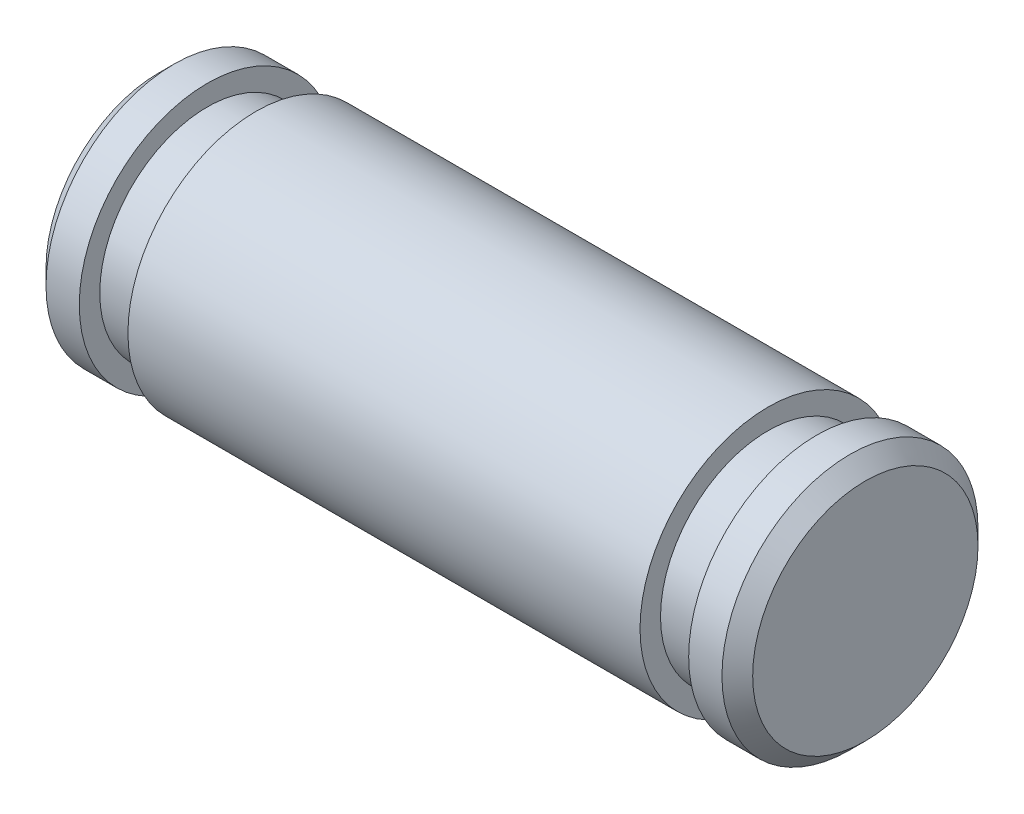
ISO-10303-21;
HEADER;
FILE_DESCRIPTION(('STEP AP214'),'2;1');
FILE_NAME('part.step','',(''),(''),'','','');
FILE_SCHEMA(('AUTOMOTIVE_DESIGN { 1 0 10303 214 1 1 1 1 }'));
ENDSEC;
DATA;
#1=APPLICATION_CONTEXT('core data for automotive mechanical design processes');
#2=APPLICATION_PROTOCOL_DEFINITION('international standard','automotive_design',2000,#1);
#3=PRODUCT_CONTEXT('',#1,'mechanical');
#4=PRODUCT('Part','Part','',(#3));
#5=PRODUCT_RELATED_PRODUCT_CATEGORY('part','',(#4));
#6=PRODUCT_DEFINITION_FORMATION('','',#4);
#7=PRODUCT_DEFINITION_CONTEXT('part definition',#1,'design');
#8=PRODUCT_DEFINITION('design','',#6,#7);
#9=PRODUCT_DEFINITION_SHAPE('','',#8);
#10=(LENGTH_UNIT() NAMED_UNIT(*) SI_UNIT(.MILLI.,.METRE.));
#11=(NAMED_UNIT(*) PLANE_ANGLE_UNIT() SI_UNIT($,.RADIAN.));
#12=(NAMED_UNIT(*) SI_UNIT($,.STERADIAN.) SOLID_ANGLE_UNIT());
#13=UNCERTAINTY_MEASURE_WITH_UNIT(LENGTH_MEASURE(1.E-05),#10,'distance_accuracy_value','');
#14=(GEOMETRIC_REPRESENTATION_CONTEXT(3) GLOBAL_UNCERTAINTY_ASSIGNED_CONTEXT((#13)) GLOBAL_UNIT_ASSIGNED_CONTEXT((#10,
#11,#12)) REPRESENTATION_CONTEXT('',''));
#15=CARTESIAN_POINT('',(0.,0.,0.));
#16=DIRECTION('',(0.,0.,1.));
#17=DIRECTION('',(1.,0.,0.));
#18=AXIS2_PLACEMENT_3D('',#15,#16,#17);
#19=CARTESIAN_POINT('',(-8.763,0.,0.));
#20=DIRECTION('',(1.,0.,0.));
#21=DIRECTION('',(0.,0.,-1.));
#22=AXIS2_PLACEMENT_3D('',#19,#20,#21);
#23=PLANE('',#22);
#24=CARTESIAN_POINT('',(-8.763,0.,0.));
#25=DIRECTION('',(-1.,0.,0.));
#26=DIRECTION('',(0.,0.,1.));
#27=AXIS2_PLACEMENT_3D('',#24,#25,#26);
#28=CIRCLE('',#27,2.794);
#29=CARTESIAN_POINT('',(-8.763,0.,2.794));
#30=VERTEX_POINT('',#29);
#31=EDGE_CURVE('E10',#30,#30,#28,.T.);
#32=ORIENTED_EDGE('',*,*,#31,.T.);
#33=EDGE_LOOP('',(#32));
#34=FACE_BOUND('',#33,.T.);
#35=ADVANCED_FACE('F32',(#34),#23,.F.);
#36=CARTESIAN_POINT('',(-8.382,0.,0.));
#37=DIRECTION('',(1.,0.,0.));
#38=DIRECTION('',(0.,0.,-1.));
#39=AXIS2_PLACEMENT_3D('',#36,#37,#38);
#40=CONICAL_SURFACE('',#39,3.175,0.785398163397449);
#41=ORIENTED_EDGE('',*,*,#31,.F.);
#42=EDGE_LOOP('',(#41));
#43=FACE_BOUND('',#42,.T.);
#44=CARTESIAN_POINT('',(-8.382,0.,0.));
#45=DIRECTION('',(-1.,0.,0.));
#46=DIRECTION('',(0.,0.,1.));
#47=AXIS2_PLACEMENT_3D('',#44,#45,#46);
#48=CIRCLE('',#47,3.175);
#49=CARTESIAN_POINT('',(-8.382,0.,3.175));
#50=VERTEX_POINT('',#49);
#51=EDGE_CURVE('E38',#50,#50,#48,.T.);
#52=ORIENTED_EDGE('',*,*,#51,.T.);
#53=EDGE_LOOP('',(#52));
#54=FACE_BOUND('',#53,.T.);
#55=ADVANCED_FACE('F88',(#43,#54),#40,.T.);
#56=CARTESIAN_POINT('',(8.763,0.,0.));
#57=DIRECTION('',(-1.,0.,0.));
#58=DIRECTION('',(0.,0.,1.));
#59=AXIS2_PLACEMENT_3D('',#56,#57,#58);
#60=CYLINDRICAL_SURFACE('',#59,3.175);
#61=ORIENTED_EDGE('',*,*,#51,.F.);
#62=EDGE_LOOP('',(#61));
#63=FACE_BOUND('',#62,.T.);
#64=CARTESIAN_POINT('',(-7.5565,0.,0.));
#65=DIRECTION('',(-1.,0.,0.));
#66=DIRECTION('',(0.,0.,1.));
#67=AXIS2_PLACEMENT_3D('',#64,#65,#66);
#68=CIRCLE('',#67,3.175);
#69=CARTESIAN_POINT('',(-7.5565,0.,3.175));
#70=VERTEX_POINT('',#69);
#71=EDGE_CURVE('E42',#70,#70,#68,.T.);
#72=ORIENTED_EDGE('',*,*,#71,.T.);
#73=EDGE_LOOP('',(#72));
#74=FACE_BOUND('',#73,.T.);
#75=ADVANCED_FACE('F92',(#63,#74),#60,.T.);
#76=CARTESIAN_POINT('',(-7.5565,3.175,0.));
#77=DIRECTION('',(-1.,0.,0.));
#78=DIRECTION('',(0.,0.,1.));
#79=AXIS2_PLACEMENT_3D('',#76,#77,#78);
#80=PLANE('',#79);
#81=ORIENTED_EDGE('',*,*,#71,.F.);
#82=EDGE_LOOP('',(#81));
#83=FACE_BOUND('',#82,.T.);
#84=CARTESIAN_POINT('',(-7.5565,0.,0.));
#85=DIRECTION('',(-1.,0.,0.));
#86=DIRECTION('',(0.,0.,1.));
#87=AXIS2_PLACEMENT_3D('',#84,#85,#86);
#88=CIRCLE('',#87,2.667);
#89=CARTESIAN_POINT('',(-7.5565,0.,2.667));
#90=VERTEX_POINT('',#89);
#91=EDGE_CURVE('E46',#90,#90,#88,.T.);
#92=ORIENTED_EDGE('',*,*,#91,.T.);
#93=EDGE_LOOP('',(#92));
#94=FACE_BOUND('',#93,.T.);
#95=ADVANCED_FACE('F97',(#83,#94),#80,.F.);
#96=CARTESIAN_POINT('',(8.763,0.,0.));
#97=DIRECTION('',(-1.,0.,0.));
#98=DIRECTION('',(0.,0.,1.));
#99=AXIS2_PLACEMENT_3D('',#96,#97,#98);
#100=CYLINDRICAL_SURFACE('',#99,2.667);
#101=ORIENTED_EDGE('',*,*,#91,.F.);
#102=EDGE_LOOP('',(#101));
#103=FACE_BOUND('',#102,.T.);
#104=CARTESIAN_POINT('',(-6.35,0.,0.));
#105=DIRECTION('',(-1.,0.,0.));
#106=DIRECTION('',(0.,0.,1.));
#107=AXIS2_PLACEMENT_3D('',#104,#105,#106);
#108=CIRCLE('',#107,2.667);
#109=CARTESIAN_POINT('',(-6.35,0.,2.667));
#110=VERTEX_POINT('',#109);
#111=EDGE_CURVE('E51',#110,#110,#108,.T.);
#112=ORIENTED_EDGE('',*,*,#111,.T.);
#113=EDGE_LOOP('',(#112));
#114=FACE_BOUND('',#113,.T.);
#115=ADVANCED_FACE('F103',(#103,#114),#100,.T.);
#116=CARTESIAN_POINT('',(-6.35,2.667,0.));
#117=DIRECTION('',(1.,0.,0.));
#118=DIRECTION('',(0.,0.,-1.));
#119=AXIS2_PLACEMENT_3D('',#116,#117,#118);
#120=PLANE('',#119);
#121=ORIENTED_EDGE('',*,*,#111,.F.);
#122=EDGE_LOOP('',(#121));
#123=FACE_BOUND('',#122,.T.);
#124=CARTESIAN_POINT('',(-6.35,0.,0.));
#125=DIRECTION('',(-1.,0.,0.));
#126=DIRECTION('',(0.,0.,1.));
#127=AXIS2_PLACEMENT_3D('',#124,#125,#126);
#128=CIRCLE('',#127,3.175);
#129=CARTESIAN_POINT('',(-6.35,0.,3.175));
#130=VERTEX_POINT('',#129);
#131=EDGE_CURVE('E54',#130,#130,#128,.T.);
#132=ORIENTED_EDGE('',*,*,#131,.T.);
#133=EDGE_LOOP('',(#132));
#134=FACE_BOUND('',#133,.T.);
#135=ADVANCED_FACE('F107',(#123,#134),#120,.F.);
#136=CARTESIAN_POINT('',(8.763,0.,0.));
#137=DIRECTION('',(-1.,0.,0.));
#138=DIRECTION('',(0.,0.,1.));
#139=AXIS2_PLACEMENT_3D('',#136,#137,#138);
#140=CYLINDRICAL_SURFACE('',#139,3.175);
#141=ORIENTED_EDGE('',*,*,#131,.F.);
#142=EDGE_LOOP('',(#141));
#143=FACE_BOUND('',#142,.T.);
#144=CARTESIAN_POINT('',(6.35,0.,0.));
#145=DIRECTION('',(-1.,0.,0.));
#146=DIRECTION('',(0.,0.,1.));
#147=AXIS2_PLACEMENT_3D('',#144,#145,#146);
#148=CIRCLE('',#147,3.175);
#149=CARTESIAN_POINT('',(6.35,0.,3.175));
#150=VERTEX_POINT('',#149);
#151=EDGE_CURVE('E57',#150,#150,#148,.T.);
#152=ORIENTED_EDGE('',*,*,#151,.T.);
#153=EDGE_LOOP('',(#152));
#154=FACE_BOUND('',#153,.T.);
#155=ADVANCED_FACE('F111',(#143,#154),#140,.T.);
#156=CARTESIAN_POINT('',(6.35,3.175,0.));
#157=DIRECTION('',(-1.,0.,0.));
#158=DIRECTION('',(0.,0.,1.));
#159=AXIS2_PLACEMENT_3D('',#156,#157,#158);
#160=PLANE('',#159);
#161=ORIENTED_EDGE('',*,*,#151,.F.);
#162=EDGE_LOOP('',(#161));
#163=FACE_BOUND('',#162,.T.);
#164=CARTESIAN_POINT('',(6.35,0.,0.));
#165=DIRECTION('',(-1.,0.,0.));
#166=DIRECTION('',(0.,0.,1.));
#167=AXIS2_PLACEMENT_3D('',#164,#165,#166);
#168=CIRCLE('',#167,2.667);
#169=CARTESIAN_POINT('',(6.35,0.,2.667));
#170=VERTEX_POINT('',#169);
#171=EDGE_CURVE('E60',#170,#170,#168,.T.);
#172=ORIENTED_EDGE('',*,*,#171,.T.);
#173=EDGE_LOOP('',(#172));
#174=FACE_BOUND('',#173,.T.);
#175=ADVANCED_FACE('F115',(#163,#174),#160,.F.);
#176=CARTESIAN_POINT('',(8.763,0.,0.));
#177=DIRECTION('',(-1.,0.,0.));
#178=DIRECTION('',(0.,0.,1.));
#179=AXIS2_PLACEMENT_3D('',#176,#177,#178);
#180=CYLINDRICAL_SURFACE('',#179,2.667);
#181=ORIENTED_EDGE('',*,*,#171,.F.);
#182=EDGE_LOOP('',(#181));
#183=FACE_BOUND('',#182,.T.);
#184=CARTESIAN_POINT('',(7.5565,0.,0.));
#185=DIRECTION('',(-1.,0.,0.));
#186=DIRECTION('',(0.,0.,1.));
#187=AXIS2_PLACEMENT_3D('',#184,#185,#186);
#188=CIRCLE('',#187,2.667);
#189=CARTESIAN_POINT('',(7.5565,0.,2.667));
#190=VERTEX_POINT('',#189);
#191=EDGE_CURVE('E63',#190,#190,#188,.T.);
#192=ORIENTED_EDGE('',*,*,#191,.T.);
#193=EDGE_LOOP('',(#192));
#194=FACE_BOUND('',#193,.T.);
#195=ADVANCED_FACE('F119',(#183,#194),#180,.T.);
#196=CARTESIAN_POINT('',(7.5565,2.667,0.));
#197=DIRECTION('',(1.,0.,0.));
#198=DIRECTION('',(0.,0.,-1.));
#199=AXIS2_PLACEMENT_3D('',#196,#197,#198);
#200=PLANE('',#199);
#201=ORIENTED_EDGE('',*,*,#191,.F.);
#202=EDGE_LOOP('',(#201));
#203=FACE_BOUND('',#202,.T.);
#204=CARTESIAN_POINT('',(7.5565,0.,0.));
#205=DIRECTION('',(-1.,0.,0.));
#206=DIRECTION('',(0.,0.,1.));
#207=AXIS2_PLACEMENT_3D('',#204,#205,#206);
#208=CIRCLE('',#207,3.175);
#209=CARTESIAN_POINT('',(7.5565,0.,3.175));
#210=VERTEX_POINT('',#209);
#211=EDGE_CURVE('E66',#210,#210,#208,.T.);
#212=ORIENTED_EDGE('',*,*,#211,.T.);
#213=EDGE_LOOP('',(#212));
#214=FACE_BOUND('',#213,.T.);
#215=ADVANCED_FACE('F123',(#203,#214),#200,.F.);
#216=CARTESIAN_POINT('',(8.763,0.,0.));
#217=DIRECTION('',(-1.,0.,0.));
#218=DIRECTION('',(0.,0.,1.));
#219=AXIS2_PLACEMENT_3D('',#216,#217,#218);
#220=CYLINDRICAL_SURFACE('',#219,3.175);
#221=ORIENTED_EDGE('',*,*,#211,.F.);
#222=EDGE_LOOP('',(#221));
#223=FACE_BOUND('',#222,.T.);
#224=CARTESIAN_POINT('',(8.382,0.,0.));
#225=DIRECTION('',(-1.,0.,0.));
#226=DIRECTION('',(0.,0.,1.));
#227=AXIS2_PLACEMENT_3D('',#224,#225,#226);
#228=CIRCLE('',#227,3.175);
#229=CARTESIAN_POINT('',(8.382,0.,3.175));
#230=VERTEX_POINT('',#229);
#231=EDGE_CURVE('E69',#230,#230,#228,.T.);
#232=ORIENTED_EDGE('',*,*,#231,.T.);
#233=EDGE_LOOP('',(#232));
#234=FACE_BOUND('',#233,.T.);
#235=ADVANCED_FACE('F84',(#223,#234),#220,.T.);
#236=CARTESIAN_POINT('',(8.763,0.,0.));
#237=DIRECTION('',(-1.,0.,0.));
#238=DIRECTION('',(0.,0.,1.));
#239=AXIS2_PLACEMENT_3D('',#236,#237,#238);
#240=CONICAL_SURFACE('',#239,2.794,0.785398163397449);
#241=ORIENTED_EDGE('',*,*,#231,.F.);
#242=EDGE_LOOP('',(#241));
#243=FACE_BOUND('',#242,.T.);
#244=CARTESIAN_POINT('',(8.763,0.,0.));
#245=DIRECTION('',(-1.,0.,0.));
#246=DIRECTION('',(0.,0.,1.));
#247=AXIS2_PLACEMENT_3D('',#244,#245,#246);
#248=CIRCLE('',#247,2.794);
#249=CARTESIAN_POINT('',(8.763,0.,2.794));
#250=VERTEX_POINT('',#249);
#251=EDGE_CURVE('E72',#250,#250,#248,.T.);
#252=ORIENTED_EDGE('',*,*,#251,.T.);
#253=EDGE_LOOP('',(#252));
#254=FACE_BOUND('',#253,.T.);
#255=ADVANCED_FACE('F76',(#243,#254),#240,.T.);
#256=CARTESIAN_POINT('',(8.763,2.794,0.));
#257=DIRECTION('',(-1.,0.,0.));
#258=DIRECTION('',(0.,0.,1.));
#259=AXIS2_PLACEMENT_3D('',#256,#257,#258);
#260=PLANE('',#259);
#261=ORIENTED_EDGE('',*,*,#251,.F.);
#262=EDGE_LOOP('',(#261));
#263=FACE_BOUND('',#262,.T.);
#264=ADVANCED_FACE('F78',(#263),#260,.F.);
#265=CLOSED_SHELL('',(#35,#55,#75,#95,#115,#135,#155,#175,#195,#215,#235,#255,#264));
#266=MANIFOLD_SOLID_BREP('B2',#265);
#267=ADVANCED_BREP_SHAPE_REPRESENTATION('',(#18,#266),#14);
#268=SHAPE_DEFINITION_REPRESENTATION(#9,#267);
ENDSEC;
END-ISO-10303-21;
